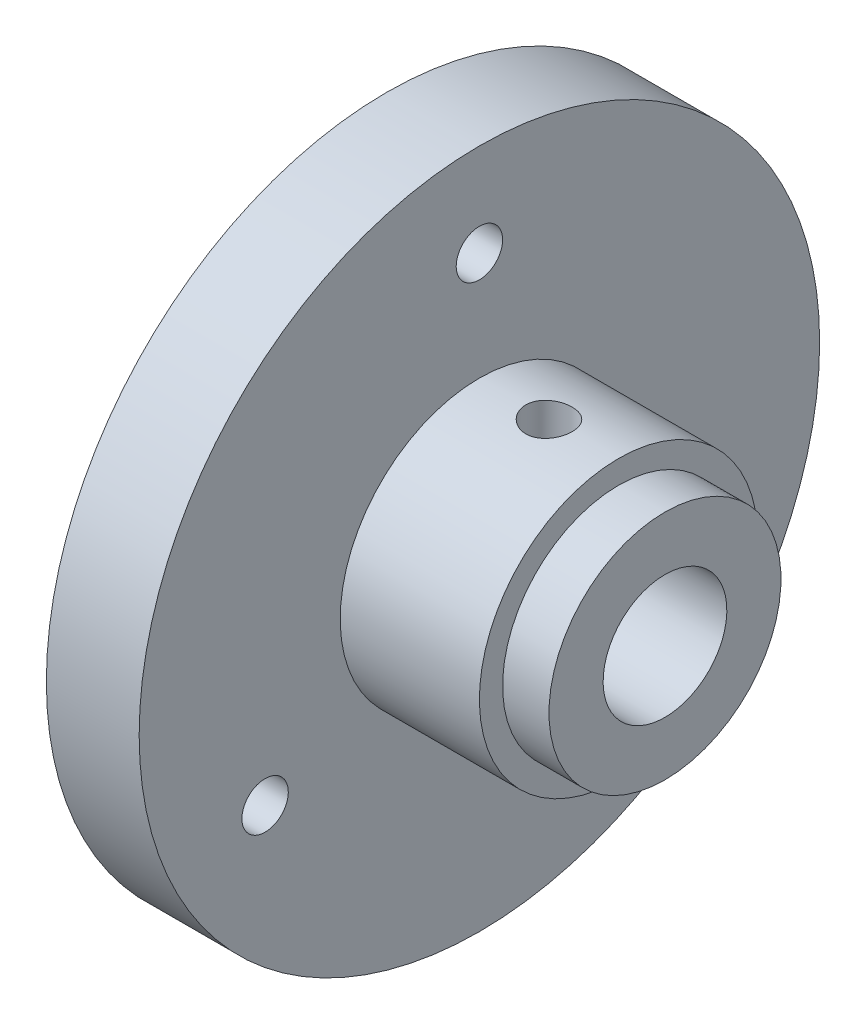
ISO-10303-21;
HEADER;
FILE_DESCRIPTION(('STEP AP214'),'2;1');
FILE_NAME('part.step','',(''),(''),'','','');
FILE_SCHEMA(('AUTOMOTIVE_DESIGN { 1 0 10303 214 1 1 1 1 }'));
ENDSEC;
DATA;
#1=APPLICATION_CONTEXT('core data for automotive mechanical design processes');
#2=APPLICATION_PROTOCOL_DEFINITION('international standard','automotive_design',2000,#1);
#3=PRODUCT_CONTEXT('',#1,'mechanical');
#4=PRODUCT('Part','Part','',(#3));
#5=PRODUCT_RELATED_PRODUCT_CATEGORY('part','',(#4));
#6=PRODUCT_DEFINITION_FORMATION('','',#4);
#7=PRODUCT_DEFINITION_CONTEXT('part definition',#1,'design');
#8=PRODUCT_DEFINITION('design','',#6,#7);
#9=PRODUCT_DEFINITION_SHAPE('','',#8);
#10=(LENGTH_UNIT() NAMED_UNIT(*) SI_UNIT(.MILLI.,.METRE.));
#11=(NAMED_UNIT(*) PLANE_ANGLE_UNIT() SI_UNIT($,.RADIAN.));
#12=(NAMED_UNIT(*) SI_UNIT($,.STERADIAN.) SOLID_ANGLE_UNIT());
#13=UNCERTAINTY_MEASURE_WITH_UNIT(LENGTH_MEASURE(1.E-05),#10,'distance_accuracy_value','');
#14=(GEOMETRIC_REPRESENTATION_CONTEXT(3) GLOBAL_UNCERTAINTY_ASSIGNED_CONTEXT((#13)) GLOBAL_UNIT_ASSIGNED_CONTEXT((#10,
#11,#12)) REPRESENTATION_CONTEXT('',''));
#15=CARTESIAN_POINT('',(0.,0.,0.));
#16=DIRECTION('',(0.,0.,1.));
#17=DIRECTION('',(1.,0.,0.));
#18=AXIS2_PLACEMENT_3D('',#15,#16,#17);
#19=CARTESIAN_POINT('',(-12.,22.,0.));
#20=DIRECTION('',(1.,0.,0.));
#21=DIRECTION('',(0.,1.,0.));
#22=AXIS2_PLACEMENT_3D('',#19,#20,#21);
#23=PLANE('',#22);
#24=CARTESIAN_POINT('',(-12.,16.,0.));
#25=DIRECTION('',(1.,0.,0.));
#26=DIRECTION('',(0.,1.,0.));
#27=AXIS2_PLACEMENT_3D('',#24,#25,#26);
#28=CIRCLE('',#27,1.5);
#29=CARTESIAN_POINT('',(-12.,17.5,0.));
#30=VERTEX_POINT('',#29);
#31=EDGE_CURVE('E84',#30,#30,#28,.T.);
#32=ORIENTED_EDGE('',*,*,#31,.F.);
#33=EDGE_LOOP('',(#32));
#34=FACE_BOUND('',#33,.T.);
#35=CARTESIAN_POINT('',(-12.,-8.,-13.856406460551));
#36=DIRECTION('',(1.,0.,0.));
#37=DIRECTION('',(0.,1.,0.));
#38=AXIS2_PLACEMENT_3D('',#35,#36,#37);
#39=CIRCLE('',#38,1.5);
#40=CARTESIAN_POINT('',(-12.,-6.5,-13.856406460551));
#41=VERTEX_POINT('',#40);
#42=EDGE_CURVE('E81',#41,#41,#39,.T.);
#43=ORIENTED_EDGE('',*,*,#42,.F.);
#44=EDGE_LOOP('',(#43));
#45=FACE_BOUND('',#44,.T.);
#46=CARTESIAN_POINT('',(-12.,-8.00000000000001,13.856406460551));
#47=DIRECTION('',(1.,0.,0.));
#48=DIRECTION('',(0.,1.,0.));
#49=AXIS2_PLACEMENT_3D('',#46,#47,#48);
#50=CIRCLE('',#49,1.5);
#51=CARTESIAN_POINT('',(-12.,-6.50000000000001,13.856406460551));
#52=VERTEX_POINT('',#51);
#53=EDGE_CURVE('E74',#52,#52,#50,.T.);
#54=ORIENTED_EDGE('',*,*,#53,.F.);
#55=EDGE_LOOP('',(#54));
#56=FACE_BOUND('',#55,.T.);
#57=CARTESIAN_POINT('',(-12.,0.,0.));
#58=DIRECTION('',(1.,0.,0.));
#59=DIRECTION('',(0.,1.,0.));
#60=AXIS2_PLACEMENT_3D('',#57,#58,#59);
#61=CIRCLE('',#60,22.);
#62=CARTESIAN_POINT('',(-12.,22.,0.));
#63=VERTEX_POINT('',#62);
#64=EDGE_CURVE('E67',#63,#63,#61,.T.);
#65=ORIENTED_EDGE('',*,*,#64,.T.);
#66=EDGE_LOOP('',(#65));
#67=FACE_BOUND('',#66,.T.);
#68=CARTESIAN_POINT('',(-12.,0.,0.));
#69=DIRECTION('',(1.,0.,0.));
#70=DIRECTION('',(0.,1.,0.));
#71=AXIS2_PLACEMENT_3D('',#68,#69,#70);
#72=CIRCLE('',#71,9.);
#73=CARTESIAN_POINT('',(-12.,9.,0.));
#74=VERTEX_POINT('',#73);
#75=EDGE_CURVE('E10',#74,#74,#72,.T.);
#76=ORIENTED_EDGE('',*,*,#75,.F.);
#77=EDGE_LOOP('',(#76));
#78=FACE_BOUND('',#77,.T.);
#79=ADVANCED_FACE('F39',(#34,#45,#56,#67,#78),#23,.T.);
#80=CARTESIAN_POINT('',(0.,0.,0.));
#81=DIRECTION('',(1.,0.,0.));
#82=DIRECTION('',(0.,1.,0.));
#83=AXIS2_PLACEMENT_3D('',#80,#81,#82);
#84=CYLINDRICAL_SURFACE('',#83,9.);
#85=CARTESIAN_POINT('',(-9.,9.,0.));
#86=CARTESIAN_POINT('',(-8.99999664663131,8.99999856701294,-0.0836345429749289));
#87=CARTESIAN_POINT('',(-8.99298163501865,8.9988220674782,-0.167314729103293));
#88=CARTESIAN_POINT('',(-8.9651186047408,8.99424206964832,-0.332328133003826));
#89=CARTESIAN_POINT('',(-8.94425786585303,8.99083652354334,-0.413659120775549));
#90=CARTESIAN_POINT('',(-8.88935073084434,8.9821804094187,-0.571562848327587));
#91=CARTESIAN_POINT('',(-8.85531512061565,8.97693135095516,-0.648139421059141));
#92=CARTESIAN_POINT('',(-8.77505262476856,8.96516536249242,-0.794485105186767));
#93=CARTESIAN_POINT('',(-8.7288271335102,8.9586485775266,-0.864254993927156));
#94=CARTESIAN_POINT('',(-8.62502694970772,8.94499990474988,-0.995683568575009));
#95=CARTESIAN_POINT('',(-8.56735853121832,8.93786323088914,-1.05726774212098));
#96=CARTESIAN_POINT('',(-8.44251121891631,8.92381576126039,-1.16993309919596));
#97=CARTESIAN_POINT('',(-8.37533172512603,8.916904979776,-1.22101361963458));
#98=CARTESIAN_POINT('',(-8.23285742028176,8.90404539455868,-1.31152027536308));
#99=CARTESIAN_POINT('',(-8.15751519791714,8.89810277454981,-1.3508727317166));
#100=CARTESIAN_POINT('',(-8.00117426141962,8.88791873876805,-1.41633501924673));
#101=CARTESIAN_POINT('',(-7.92017592979342,8.88367720808584,-1.44244574493937));
#102=CARTESIAN_POINT('',(-7.75561183508607,8.87742322105653,-1.48044862667088));
#103=CARTESIAN_POINT('',(-7.67207655809916,8.8753906109142,-1.49246941748124));
#104=CARTESIAN_POINT('',(-7.50415183386991,8.87372363361989,-1.50235003517392));
#105=CARTESIAN_POINT('',(-7.41976244749962,8.87408909674328,-1.5002108642334));
#106=CARTESIAN_POINT('',(-7.25344328323473,8.87715857318133,-1.48193705903769));
#107=CARTESIAN_POINT('',(-7.17149711787286,8.8798384399135,-1.46594692913386));
#108=CARTESIAN_POINT('',(-7.01146720930251,8.88719697126605,-1.42065188424207));
#109=CARTESIAN_POINT('',(-6.93338359866687,8.89187570443963,-1.39134651259184));
#110=CARTESIAN_POINT('',(-6.78286270593544,8.9027308760046,-1.32010634765635));
#111=CARTESIAN_POINT('',(-6.71045435635126,8.90891440264395,-1.27811154832783));
#112=CARTESIAN_POINT('',(-6.57365735967696,8.92207751049005,-1.18272721053446));
#113=CARTESIAN_POINT('',(-6.50926936052704,8.92905715592572,-1.12933675239257));
#114=CARTESIAN_POINT('',(-6.38950434851559,8.94313216727871,-1.01188932729543));
#115=CARTESIAN_POINT('',(-6.33424888887594,8.95022789538991,-0.947708378323875));
#116=CARTESIAN_POINT('',(-6.23527334240079,8.96365560838034,-0.810921149388986));
#117=CARTESIAN_POINT('',(-6.19155332989006,8.96998758833847,-0.738314815143851));
#118=CARTESIAN_POINT('',(-6.11687866371823,8.98118335735747,-0.586623549700024));
#119=CARTESIAN_POINT('',(-6.08593474840124,8.98604591044468,-0.507533235338794));
#120=CARTESIAN_POINT('',(-6.03780347085241,8.99374501807596,-0.345179007361636));
#121=CARTESIAN_POINT('',(-6.02061495781576,8.99658174210284,-0.261915443507678));
#122=CARTESIAN_POINT('',(-6.00064718492331,8.99988677905612,-0.0946259407809717));
#123=CARTESIAN_POINT('',(-5.99770105691663,9.00038251807671,-0.0106204422906042));
#124=CARTESIAN_POINT('',(-6.00585680665687,8.99902484652702,0.156683863733935));
#125=CARTESIAN_POINT('',(-6.01695814388024,8.99717152634471,0.239982698335226));
#126=CARTESIAN_POINT('',(-6.05275490960128,8.99134096162921,0.40299370532806));
#127=CARTESIAN_POINT('',(-6.07736772503407,8.98737662880787,0.482724521031229));
#128=CARTESIAN_POINT('',(-6.13940071091972,8.97776678673215,0.636928130916267));
#129=CARTESIAN_POINT('',(-6.17682160058116,8.97212118307212,0.711400629545833));
#130=CARTESIAN_POINT('',(-6.26379067481807,8.95970709781445,0.853698413681377));
#131=CARTESIAN_POINT('',(-6.31344309370035,8.95292913532213,0.921459150562291));
#132=CARTESIAN_POINT('',(-6.42332238923103,8.93903080435141,1.04774615130162));
#133=CARTESIAN_POINT('',(-6.483550033966,8.93191041102928,1.10627174381795));
#134=CARTESIAN_POINT('',(-6.61361852884285,8.91804105141507,1.2130456677948));
#135=CARTESIAN_POINT('',(-6.68355249930864,8.91129669682264,1.26118125666823));
#136=CARTESIAN_POINT('',(-6.83061178148312,8.8990291786673,1.34502138617699));
#137=CARTESIAN_POINT('',(-6.90773686513649,8.89350597639612,1.3807263208619));
#138=CARTESIAN_POINT('',(-7.06667383968728,8.88434072218623,1.43852299888389));
#139=CARTESIAN_POINT('',(-7.14846485701829,8.88069092586639,1.46067085952877));
#140=CARTESIAN_POINT('',(-7.31467207753306,8.87566630101156,1.49090127226697));
#141=CARTESIAN_POINT('',(-7.39908805183923,8.87429127469633,1.4989850471677));
#142=CARTESIAN_POINT('',(-7.56702309957744,8.87398039850407,1.50082371962841));
#143=CARTESIAN_POINT('',(-7.65054022714517,8.8750143390339,1.49475608167511));
#144=CARTESIAN_POINT('',(-7.81534754883046,8.87933868872237,1.46884790337411));
#145=CARTESIAN_POINT('',(-7.89663775016512,8.88262909056728,1.44900740766749));
#146=CARTESIAN_POINT('',(-8.05461506237557,8.89108413769031,1.39618469375694));
#147=CARTESIAN_POINT('',(-8.13130740603361,8.89624660331802,1.36321775436027));
#148=CARTESIAN_POINT('',(-8.27810140151691,8.90786621353324,1.28509620234954));
#149=CARTESIAN_POINT('',(-8.34820272622328,8.91432342233039,1.23994098524914));
#150=CARTESIAN_POINT('',(-8.48072134986465,8.92790072427373,1.13809133062329));
#151=CARTESIAN_POINT('',(-8.54303761002016,8.93502777345781,1.08126633815619));
#152=CARTESIAN_POINT('',(-8.65731096268496,8.94908623416504,0.957965418828138));
#153=CARTESIAN_POINT('',(-8.7092656611829,8.95601760015928,0.891487267747582));
#154=CARTESIAN_POINT('',(-8.80166896091996,8.96895917785332,0.750221501784169));
#155=CARTESIAN_POINT('',(-8.84203562358777,8.97496269751862,0.675379672519692));
#156=CARTESIAN_POINT('',(-8.90956169076595,8.98530700561065,0.519907841627389));
#157=CARTESIAN_POINT('',(-8.93673424864782,8.98964944906489,0.439283696898006));
#158=CARTESIAN_POINT('',(-8.971203164476,8.99523474499773,0.29862198602724));
#159=CARTESIAN_POINT('',(-8.98198468176957,8.99701216364015,0.239435298179067));
#160=CARTESIAN_POINT('',(-8.99638424270685,8.99939529591672,0.120173586191885));
#161=CARTESIAN_POINT('',(-9.00000240968241,9.00000102972385,0.0600985773650961));
#162=CARTESIAN_POINT('',(-9.,9.,0.));
#163=B_SPLINE_CURVE_WITH_KNOTS('',3,(#85,#86,#87,#88,#89,#90,#91,#92,#93,#94,#95,#96,#97,#98,
#99,#100,#101,#102,#103,#104,#105,#106,#107,#108,#109,#110,#111,#112,#113,#114,#115,#116,#117,
#118,#119,#120,#121,#122,#123,#124,#125,#126,#127,#128,#129,#130,#131,#132,#133,#134,#135,#136,
#137,#138,#139,#140,#141,#142,#143,#144,#145,#146,#147,#148,#149,#150,#151,#152,#153,#154,#155,
#156,#157,#158,#159,#160,#161,#162),.UNSPECIFIED.,.T.,.F.,(4,2,2,2,2,2,2,2,2,2,2,2,2,2,2,2,2,2,
2,2,2,2,2,2,2,2,2,2,2,2,2,2,2,2,2,2,2,2,4),(0.,0.250683950963106,0.501598527417253,
0.752308120215163,1.00298904760488,1.25581494637399,1.50865680101914,1.76305512494304,
2.01743626125709,2.26947646262054,2.52149882592532,2.77092313056245,3.02035599015229,
3.27098733979535,3.52163892408344,3.77539661946796,4.02915594981509,4.28312813349542,
4.5370790671269,4.78804730094839,5.03900587821516,5.28844684203849,5.5379018149564,
5.78956095376214,6.0412383783257,6.29552293204572,6.54979942425566,6.80301613405064,
7.05621082671971,7.30624745713621,7.5562832771288,7.80602890935734,8.05578693017602,
8.30850830516035,8.56128800327384,8.8158133896432,9.07008451278043,9.25022548898411,
9.43036336366181),.UNSPECIFIED.);
#164=CARTESIAN_POINT('',(-9.,9.,0.));
#165=VERTEX_POINT('',#164);
#166=EDGE_CURVE('E96',#165,#165,#163,.T.);
#167=ORIENTED_EDGE('',*,*,#166,.T.);
#168=EDGE_LOOP('',(#167));
#169=FACE_BOUND('',#168,.T.);
#170=ORIENTED_EDGE('',*,*,#75,.T.);
#171=EDGE_LOOP('',(#170));
#172=FACE_BOUND('',#171,.T.);
#173=CARTESIAN_POINT('',(-3.,0.,0.));
#174=DIRECTION('',(1.,0.,0.));
#175=DIRECTION('',(0.,1.,0.));
#176=AXIS2_PLACEMENT_3D('',#173,#174,#175);
#177=CIRCLE('',#176,9.);
#178=CARTESIAN_POINT('',(-3.,9.,0.));
#179=VERTEX_POINT('',#178);
#180=EDGE_CURVE('E45',#179,#179,#177,.T.);
#181=ORIENTED_EDGE('',*,*,#180,.F.);
#182=EDGE_LOOP('',(#181));
#183=FACE_BOUND('',#182,.T.);
#184=ADVANCED_FACE('F143',(#169,#172,#183),#84,.T.);
#185=CARTESIAN_POINT('',(-3.,9.,0.));
#186=DIRECTION('',(1.,0.,0.));
#187=DIRECTION('',(0.,1.,0.));
#188=AXIS2_PLACEMENT_3D('',#185,#186,#187);
#189=PLANE('',#188);
#190=ORIENTED_EDGE('',*,*,#180,.T.);
#191=EDGE_LOOP('',(#190));
#192=FACE_BOUND('',#191,.T.);
#193=CARTESIAN_POINT('',(-3.,0.,0.));
#194=DIRECTION('',(1.,0.,0.));
#195=DIRECTION('',(0.,1.,0.));
#196=AXIS2_PLACEMENT_3D('',#193,#194,#195);
#197=CIRCLE('',#196,7.5);
#198=CARTESIAN_POINT('',(-3.,7.5,0.));
#199=VERTEX_POINT('',#198);
#200=EDGE_CURVE('E49',#199,#199,#197,.T.);
#201=ORIENTED_EDGE('',*,*,#200,.F.);
#202=EDGE_LOOP('',(#201));
#203=FACE_BOUND('',#202,.T.);
#204=ADVANCED_FACE('F140',(#192,#203),#189,.T.);
#205=CARTESIAN_POINT('',(0.,0.,0.));
#206=DIRECTION('',(1.,0.,0.));
#207=DIRECTION('',(0.,1.,0.));
#208=AXIS2_PLACEMENT_3D('',#205,#206,#207);
#209=CYLINDRICAL_SURFACE('',#208,7.5);
#210=ORIENTED_EDGE('',*,*,#200,.T.);
#211=EDGE_LOOP('',(#210));
#212=FACE_BOUND('',#211,.T.);
#213=CARTESIAN_POINT('',(0.,0.,0.));
#214=DIRECTION('',(1.,0.,0.));
#215=DIRECTION('',(0.,1.,0.));
#216=AXIS2_PLACEMENT_3D('',#213,#214,#215);
#217=CIRCLE('',#216,7.5);
#218=CARTESIAN_POINT('',(0.,7.5,0.));
#219=VERTEX_POINT('',#218);
#220=EDGE_CURVE('E53',#219,#219,#217,.T.);
#221=ORIENTED_EDGE('',*,*,#220,.F.);
#222=EDGE_LOOP('',(#221));
#223=FACE_BOUND('',#222,.T.);
#224=ADVANCED_FACE('F136',(#212,#223),#209,.T.);
#225=CARTESIAN_POINT('',(0.,4.,0.));
#226=DIRECTION('',(1.,0.,0.));
#227=DIRECTION('',(0.,1.,0.));
#228=AXIS2_PLACEMENT_3D('',#225,#226,#227);
#229=PLANE('',#228);
#230=ORIENTED_EDGE('',*,*,#220,.T.);
#231=EDGE_LOOP('',(#230));
#232=FACE_BOUND('',#231,.T.);
#233=CARTESIAN_POINT('',(0.,0.,0.));
#234=DIRECTION('',(1.,0.,0.));
#235=DIRECTION('',(0.,1.,0.));
#236=AXIS2_PLACEMENT_3D('',#233,#234,#235);
#237=CIRCLE('',#236,4.);
#238=CARTESIAN_POINT('',(0.,4.,0.));
#239=VERTEX_POINT('',#238);
#240=EDGE_CURVE('E58',#239,#239,#237,.T.);
#241=ORIENTED_EDGE('',*,*,#240,.F.);
#242=EDGE_LOOP('',(#241));
#243=FACE_BOUND('',#242,.T.);
#244=ADVANCED_FACE('F132',(#232,#243),#229,.T.);
#245=CARTESIAN_POINT('',(0.,0.,0.));
#246=DIRECTION('',(1.,0.,0.));
#247=DIRECTION('',(0.,1.,0.));
#248=AXIS2_PLACEMENT_3D('',#245,#246,#247);
#249=CYLINDRICAL_SURFACE('',#248,4.);
#250=CARTESIAN_POINT('',(-9.,4.,0.));
#251=CARTESIAN_POINT('',(-9.00000290230311,4.00000217456151,0.0812350589378535));
#252=CARTESIAN_POINT('',(-8.99338023975161,3.99750379283184,0.162450241781793));
#253=CARTESIAN_POINT('',(-8.96717180473007,3.98778696006928,0.322453452352361));
#254=CARTESIAN_POINT('',(-8.94758789952943,3.98056918893993,0.401241827987616));
#255=CARTESIAN_POINT('',(-8.89624699822824,3.96218832391545,0.554060784990879));
#256=CARTESIAN_POINT('',(-8.86451348317821,3.9510328434944,0.628100224162279));
#257=CARTESIAN_POINT('',(-8.78989358698418,3.92588767765353,0.769799310160254));
#258=CARTESIAN_POINT('',(-8.74700421445584,3.91189723227548,0.83745723917788));
#259=CARTESIAN_POINT('',(-8.64938746892909,3.88186246971216,0.967346417045826));
#260=CARTESIAN_POINT('',(-8.59426973774059,3.86576002583566,1.02927073015119));
#261=CARTESIAN_POINT('',(-8.47458956534115,3.83360220871327,1.14324421474363));
#262=CARTESIAN_POINT('',(-8.41002424391212,3.81754685135033,1.19529036359203));
#263=CARTESIAN_POINT('',(-8.27028253247679,3.78662470617731,1.28998202215985));
#264=CARTESIAN_POINT('',(-8.19479563345418,3.77182648820818,1.3321939319576));
#265=CARTESIAN_POINT('',(-8.03715164583148,3.74599860237433,1.40318646334084));
#266=CARTESIAN_POINT('',(-7.95499723684489,3.73496742975881,1.43197244961239));
#267=CARTESIAN_POINT('',(-7.7898832597418,3.71854412824136,1.47408431017549));
#268=CARTESIAN_POINT('',(-7.70709496156455,3.71293924350838,1.48799593218558));
#269=CARTESIAN_POINT('',(-7.54018384200615,3.70738061461214,1.50179556531648));
#270=CARTESIAN_POINT('',(-7.45606158612553,3.70742453659304,1.50168936802631));
#271=CARTESIAN_POINT('',(-7.29423047478704,3.71297511632054,1.48790429610018));
#272=CARTESIAN_POINT('',(-7.21643909395582,3.71815468871121,1.47503808509004));
#273=CARTESIAN_POINT('',(-7.06421284959468,3.73284938059529,1.4374416786833));
#274=CARTESIAN_POINT('',(-6.98977849338612,3.74236515298863,1.41270969663259));
#275=CARTESIAN_POINT('',(-6.84472293227176,3.76485702190253,1.35163748571904));
#276=CARTESIAN_POINT('',(-6.77420051387869,3.77789517988166,1.31508648737101));
#277=CARTESIAN_POINT('',(-6.64005426240902,3.80594210139319,1.23156073762698));
#278=CARTESIAN_POINT('',(-6.5764328224803,3.82095154457158,1.18458238728897));
#279=CARTESIAN_POINT('',(-6.45339633634912,3.85248038859113,1.07781780766549));
#280=CARTESIAN_POINT('',(-6.3945513592519,3.8690334745567,1.01738298716956));
#281=CARTESIAN_POINT('',(-6.2876620337942,3.90091728164085,0.887312590819021));
#282=CARTESIAN_POINT('',(-6.23961934539432,3.91624781465952,0.817675603497365));
#283=CARTESIAN_POINT('',(-6.15506960293747,3.9442639480908,0.669723436992421));
#284=CARTESIAN_POINT('',(-6.11875241877893,3.95690498259616,0.591290713844721));
#285=CARTESIAN_POINT('',(-6.06001739572995,3.97778718326962,0.428836850524585));
#286=CARTESIAN_POINT('',(-6.03759338343888,3.98603030341493,0.344818210845769));
#287=CARTESIAN_POINT('',(-6.00837721245806,3.99684443228065,0.178375243148666));
#288=CARTESIAN_POINT('',(-6.00081739361748,3.99969369025686,0.0961036195622106));
#289=CARTESIAN_POINT('',(-5.99930893610007,4.00025893700126,-0.068572475255023));
#290=CARTESIAN_POINT('',(-6.00535727968322,3.99797606386863,-0.150976912983372));
#291=CARTESIAN_POINT('',(-6.03031004230867,3.98871709772643,-0.310262048561858));
#292=CARTESIAN_POINT('',(-6.04871154373708,3.98192470962305,-0.387233328007334));
#293=CARTESIAN_POINT('',(-6.09718607254731,3.96451477091717,-0.536941754957219));
#294=CARTESIAN_POINT('',(-6.12726061794803,3.9538967228203,-0.609678350347533));
#295=CARTESIAN_POINT('',(-6.19918641243947,3.92949624407681,-0.751247765110154));
#296=CARTESIAN_POINT('',(-6.24135772922338,3.91563000209348,-0.819903083557794));
#297=CARTESIAN_POINT('',(-6.33591810317155,3.88626671564664,-0.949392711726624));
#298=CARTESIAN_POINT('',(-6.38831093254515,3.87076907009516,-1.01022412027045));
#299=CARTESIAN_POINT('',(-6.50540412212427,3.83873329490989,-1.12603079874454));
#300=CARTESIAN_POINT('',(-6.57064218277269,3.82218696503729,-1.18046154123568));
#301=CARTESIAN_POINT('',(-6.70965138470765,3.79078815746854,-1.27771050031903));
#302=CARTESIAN_POINT('',(-6.78342329138849,3.77593583194399,-1.32052767414518));
#303=CARTESIAN_POINT('',(-6.93801598677231,3.74966829822463,-1.39337773518998));
#304=CARTESIAN_POINT('',(-7.01886474591043,3.73826760328493,-1.42335685446918));
#305=CARTESIAN_POINT('',(-7.18500976368782,3.72054032891005,-1.46907883466889));
#306=CARTESIAN_POINT('',(-7.27030323619812,3.71421061057491,-1.48483050305535));
#307=CARTESIAN_POINT('',(-7.43701615954111,3.70775894792573,-1.50086347097839));
#308=CARTESIAN_POINT('',(-7.51833263171688,3.70726444523341,-1.50207331495837));
#309=CARTESIAN_POINT('',(-7.67994531627616,3.71158412745292,-1.49136715641593));
#310=CARTESIAN_POINT('',(-7.76024162467158,3.71639780898899,-1.47945239850124));
#311=CARTESIAN_POINT('',(-7.91504722671655,3.73048141585432,-1.44355815630242));
#312=CARTESIAN_POINT('',(-7.98965834624534,3.73961085376663,-1.41995798316524));
#313=CARTESIAN_POINT('',(-8.13390550849441,3.76121548297845,-1.3616969677992));
#314=CARTESIAN_POINT('',(-8.20354028807014,3.77369151995214,-1.32703332944945));
#315=CARTESIAN_POINT('',(-8.33982678969763,3.80139723903964,-1.24552075938154));
#316=CARTESIAN_POINT('',(-8.40613079679991,3.81673698440964,-1.1981283280301));
#317=CARTESIAN_POINT('',(-8.5301415609712,3.84806246757177,-1.09334485729906));
#318=CARTESIAN_POINT('',(-8.58784557478675,3.86404840943145,-1.03595064012808));
#319=CARTESIAN_POINT('',(-8.69620195582184,3.89590424609881,-0.909080396784623));
#320=CARTESIAN_POINT('',(-8.74630375343467,3.91172104900645,-0.839118644212993));
#321=CARTESIAN_POINT('',(-8.83402265527655,3.9405451445703,-0.691213223200822));
#322=CARTESIAN_POINT('',(-8.87163878773636,3.95355221851559,-0.613268934090622));
#323=CARTESIAN_POINT('',(-8.93437682904832,3.9757429260668,-0.447999082002312));
#324=CARTESIAN_POINT('',(-8.95888706460189,3.98473657158356,-0.360413422234208));
#325=CARTESIAN_POINT('',(-8.99169295992068,3.99686242179587,-0.181875733606382));
#326=CARTESIAN_POINT('',(-8.99999675148732,3.99999756603967,-0.0909254163648584));
#327=CARTESIAN_POINT('',(-9.,4.,0.));
#328=B_SPLINE_CURVE_WITH_KNOTS('',3,(#250,#251,#252,#253,#254,#255,#256,#257,#258,#259,#260,
#261,#262,#263,#264,#265,#266,#267,#268,#269,#270,#271,#272,#273,#274,#275,#276,#277,#278,#279,
#280,#281,#282,#283,#284,#285,#286,#287,#288,#289,#290,#291,#292,#293,#294,#295,#296,#297,#298,
#299,#300,#301,#302,#303,#304,#305,#306,#307,#308,#309,#310,#311,#312,#313,#314,#315,#316,#317,
#318,#319,#320,#321,#322,#323,#324,#325,#326,#327),.UNSPECIFIED.,.T.,.F.,(4,2,2,2,2,2,2,2,2,2,2,
2,2,2,2,2,2,2,2,2,2,2,2,2,2,2,2,2,2,2,2,2,2,2,2,2,2,2,4),(0.,0.24336980156056,0.48670454953046,
0.729571369213574,0.972503379609489,1.22473618582715,1.47704604925622,1.73896674501659,
2.00078269352134,2.25185874416902,2.50283106079707,2.73878345119971,2.97477138060589,
3.21522408387018,3.45575990744259,3.71246153335813,3.96920257905066,4.22991375286075,
4.49050899698846,4.73725019635925,4.98393668390521,5.2211443792384,5.45838293254454,
5.702592218596,5.94689180019868,6.20536519455658,6.46386178920141,6.72343066727204,
6.98283874956507,7.22558763480252,7.46831350211259,7.70363142426534,7.93900886656507,
8.18672471884271,8.43451941997062,8.69572329654039,8.95694749805102,9.22948515032042,
9.50188601796128),.UNSPECIFIED.);
#329=CARTESIAN_POINT('',(-9.,4.,0.));
#330=VERTEX_POINT('',#329);
#331=EDGE_CURVE('E75',#330,#330,#328,.T.);
#332=ORIENTED_EDGE('',*,*,#331,.T.);
#333=EDGE_LOOP('',(#332));
#334=FACE_BOUND('',#333,.T.);
#335=ORIENTED_EDGE('',*,*,#240,.T.);
#336=EDGE_LOOP('',(#335));
#337=FACE_BOUND('',#336,.T.);
#338=CARTESIAN_POINT('',(-18.,0.,0.));
#339=DIRECTION('',(1.,0.,0.));
#340=DIRECTION('',(0.,1.,0.));
#341=AXIS2_PLACEMENT_3D('',#338,#339,#340);
#342=CIRCLE('',#341,4.);
#343=CARTESIAN_POINT('',(-18.,4.,0.));
#344=VERTEX_POINT('',#343);
#345=EDGE_CURVE('E61',#344,#344,#342,.T.);
#346=ORIENTED_EDGE('',*,*,#345,.F.);
#347=EDGE_LOOP('',(#346));
#348=FACE_BOUND('',#347,.T.);
#349=ADVANCED_FACE('F128',(#334,#337,#348),#249,.F.);
#350=CARTESIAN_POINT('',(-18.,4.,0.));
#351=DIRECTION('',(-1.,0.,0.));
#352=DIRECTION('',(0.,-1.,0.));
#353=AXIS2_PLACEMENT_3D('',#350,#351,#352);
#354=PLANE('',#353);
#355=CARTESIAN_POINT('',(-18.,16.,0.));
#356=DIRECTION('',(1.,0.,0.));
#357=DIRECTION('',(0.,1.,0.));
#358=AXIS2_PLACEMENT_3D('',#355,#356,#357);
#359=CIRCLE('',#358,1.5);
#360=CARTESIAN_POINT('',(-18.,17.5,0.));
#361=VERTEX_POINT('',#360);
#362=EDGE_CURVE('E70',#361,#361,#359,.T.);
#363=ORIENTED_EDGE('',*,*,#362,.T.);
#364=EDGE_LOOP('',(#363));
#365=FACE_BOUND('',#364,.T.);
#366=CARTESIAN_POINT('',(-18.,-8.,-13.856406460551));
#367=DIRECTION('',(1.,0.,0.));
#368=DIRECTION('',(0.,1.,0.));
#369=AXIS2_PLACEMENT_3D('',#366,#367,#368);
#370=CIRCLE('',#369,1.5);
#371=CARTESIAN_POINT('',(-18.,-6.5,-13.856406460551));
#372=VERTEX_POINT('',#371);
#373=EDGE_CURVE('E78',#372,#372,#370,.T.);
#374=ORIENTED_EDGE('',*,*,#373,.T.);
#375=EDGE_LOOP('',(#374));
#376=FACE_BOUND('',#375,.T.);
#377=CARTESIAN_POINT('',(-18.,-8.00000000000001,13.856406460551));
#378=DIRECTION('',(1.,0.,0.));
#379=DIRECTION('',(0.,1.,0.));
#380=AXIS2_PLACEMENT_3D('',#377,#378,#379);
#381=CIRCLE('',#380,1.5);
#382=CARTESIAN_POINT('',(-18.,-6.50000000000001,13.856406460551));
#383=VERTEX_POINT('',#382);
#384=EDGE_CURVE('E71',#383,#383,#381,.T.);
#385=ORIENTED_EDGE('',*,*,#384,.T.);
#386=EDGE_LOOP('',(#385));
#387=FACE_BOUND('',#386,.T.);
#388=ORIENTED_EDGE('',*,*,#345,.T.);
#389=EDGE_LOOP('',(#388));
#390=FACE_BOUND('',#389,.T.);
#391=CARTESIAN_POINT('',(-18.,0.,0.));
#392=DIRECTION('',(1.,0.,0.));
#393=DIRECTION('',(0.,1.,0.));
#394=AXIS2_PLACEMENT_3D('',#391,#392,#393);
#395=CIRCLE('',#394,22.);
#396=CARTESIAN_POINT('',(-18.,22.,0.));
#397=VERTEX_POINT('',#396);
#398=EDGE_CURVE('E64',#397,#397,#395,.T.);
#399=ORIENTED_EDGE('',*,*,#398,.F.);
#400=EDGE_LOOP('',(#399));
#401=FACE_BOUND('',#400,.T.);
#402=ADVANCED_FACE('F124',(#365,#376,#387,#390,#401),#354,.T.);
#403=CARTESIAN_POINT('',(0.,0.,0.));
#404=DIRECTION('',(1.,0.,0.));
#405=DIRECTION('',(0.,1.,0.));
#406=AXIS2_PLACEMENT_3D('',#403,#404,#405);
#407=CYLINDRICAL_SURFACE('',#406,22.);
#408=ORIENTED_EDGE('',*,*,#398,.T.);
#409=EDGE_LOOP('',(#408));
#410=FACE_BOUND('',#409,.T.);
#411=ORIENTED_EDGE('',*,*,#64,.F.);
#412=EDGE_LOOP('',(#411));
#413=FACE_BOUND('',#412,.T.);
#414=ADVANCED_FACE('F120',(#410,#413),#407,.T.);
#415=CARTESIAN_POINT('',(-18.,-8.00000000000001,13.856406460551));
#416=DIRECTION('',(1.,0.,0.));
#417=DIRECTION('',(0.,1.,0.));
#418=AXIS2_PLACEMENT_3D('',#415,#416,#417);
#419=CYLINDRICAL_SURFACE('',#418,1.5);
#420=ORIENTED_EDGE('',*,*,#384,.F.);
#421=EDGE_LOOP('',(#420));
#422=FACE_BOUND('',#421,.T.);
#423=ORIENTED_EDGE('',*,*,#53,.T.);
#424=EDGE_LOOP('',(#423));
#425=FACE_BOUND('',#424,.T.);
#426=ADVANCED_FACE('F116',(#422,#425),#419,.F.);
#427=CARTESIAN_POINT('',(-18.,-8.,-13.856406460551));
#428=DIRECTION('',(1.,0.,0.));
#429=DIRECTION('',(0.,1.,0.));
#430=AXIS2_PLACEMENT_3D('',#427,#428,#429);
#431=CYLINDRICAL_SURFACE('',#430,1.5);
#432=ORIENTED_EDGE('',*,*,#373,.F.);
#433=EDGE_LOOP('',(#432));
#434=FACE_BOUND('',#433,.T.);
#435=ORIENTED_EDGE('',*,*,#42,.T.);
#436=EDGE_LOOP('',(#435));
#437=FACE_BOUND('',#436,.T.);
#438=ADVANCED_FACE('F112',(#434,#437),#431,.F.);
#439=CARTESIAN_POINT('',(-18.,16.,0.));
#440=DIRECTION('',(1.,0.,0.));
#441=DIRECTION('',(0.,1.,0.));
#442=AXIS2_PLACEMENT_3D('',#439,#440,#441);
#443=CYLINDRICAL_SURFACE('',#442,1.5);
#444=ORIENTED_EDGE('',*,*,#362,.F.);
#445=EDGE_LOOP('',(#444));
#446=FACE_BOUND('',#445,.T.);
#447=ORIENTED_EDGE('',*,*,#31,.T.);
#448=EDGE_LOOP('',(#447));
#449=FACE_BOUND('',#448,.T.);
#450=ADVANCED_FACE('F107',(#446,#449),#443,.F.);
#451=CARTESIAN_POINT('',(-7.49999999999999,-22.001,0.));
#452=DIRECTION('',(0.,1.,0.));
#453=DIRECTION('',(-1.,0.,0.));
#454=AXIS2_PLACEMENT_3D('',#451,#452,#453);
#455=CYLINDRICAL_SURFACE('',#454,1.5);
#456=ORIENTED_EDGE('',*,*,#331,.F.);
#457=EDGE_LOOP('',(#456));
#458=FACE_BOUND('',#457,.T.);
#459=ORIENTED_EDGE('',*,*,#166,.F.);
#460=EDGE_LOOP('',(#459));
#461=FACE_BOUND('',#460,.T.);
#462=ADVANCED_FACE('F101',(#458,#461),#455,.F.);
#463=CLOSED_SHELL('',(#79,#184,#204,#224,#244,#349,#402,#414,#426,#438,#450,#462));
#464=MANIFOLD_SOLID_BREP('B2',#463);
#465=ADVANCED_BREP_SHAPE_REPRESENTATION('',(#18,#464),#14);
#466=SHAPE_DEFINITION_REPRESENTATION(#9,#465);
ENDSEC;
END-ISO-10303-21;
